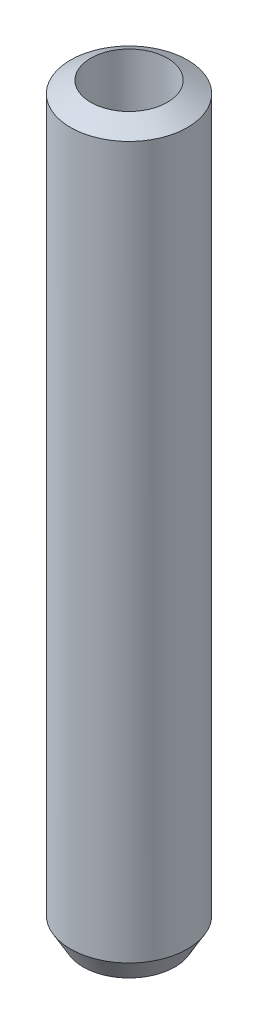
ISO-10303-21;
HEADER;
FILE_DESCRIPTION(('STEP AP214'),'2;1');
FILE_NAME('part.step','',(''),(''),'','','');
FILE_SCHEMA(('AUTOMOTIVE_DESIGN { 1 0 10303 214 1 1 1 1 }'));
ENDSEC;
DATA;
#1=APPLICATION_CONTEXT('core data for automotive mechanical design processes');
#2=APPLICATION_PROTOCOL_DEFINITION('international standard','automotive_design',2000,#1);
#3=PRODUCT_CONTEXT('',#1,'mechanical');
#4=PRODUCT('Part','Part','',(#3));
#5=PRODUCT_RELATED_PRODUCT_CATEGORY('part','',(#4));
#6=PRODUCT_DEFINITION_FORMATION('','',#4);
#7=PRODUCT_DEFINITION_CONTEXT('part definition',#1,'design');
#8=PRODUCT_DEFINITION('design','',#6,#7);
#9=PRODUCT_DEFINITION_SHAPE('','',#8);
#10=(LENGTH_UNIT() NAMED_UNIT(*) SI_UNIT(.MILLI.,.METRE.));
#11=(NAMED_UNIT(*) PLANE_ANGLE_UNIT() SI_UNIT($,.RADIAN.));
#12=(NAMED_UNIT(*) SI_UNIT($,.STERADIAN.) SOLID_ANGLE_UNIT());
#13=UNCERTAINTY_MEASURE_WITH_UNIT(LENGTH_MEASURE(1.E-05),#10,'distance_accuracy_value','');
#14=(GEOMETRIC_REPRESENTATION_CONTEXT(3) GLOBAL_UNCERTAINTY_ASSIGNED_CONTEXT((#13)) GLOBAL_UNIT_ASSIGNED_CONTEXT((#10,
#11,#12)) REPRESENTATION_CONTEXT('',''));
#15=CARTESIAN_POINT('',(0.,0.,0.));
#16=DIRECTION('',(0.,0.,1.));
#17=DIRECTION('',(1.,0.,0.));
#18=AXIS2_PLACEMENT_3D('',#15,#16,#17);
#19=CARTESIAN_POINT('',(0.,223.172952411425,0.));
#20=DIRECTION('',(0.,-1.,0.));
#21=DIRECTION('',(0.,0.,-1.));
#22=AXIS2_PLACEMENT_3D('',#19,#20,#21);
#23=CYLINDRICAL_SURFACE('',#22,17.5);
#24=CARTESIAN_POINT('',(0.,219.380455718945,0.));
#25=DIRECTION('',(0.,1.,0.));
#26=DIRECTION('',(0.,0.,1.));
#27=AXIS2_PLACEMENT_3D('',#24,#25,#26);
#28=CIRCLE('',#27,17.5);
#29=CARTESIAN_POINT('',(0.,219.380455718945,-17.5));
#30=VERTEX_POINT('',#29);
#31=EDGE_CURVE('E50',#30,#30,#28,.F.);
#32=ORIENTED_EDGE('',*,*,#31,.T.);
#33=EDGE_LOOP('',(#32));
#34=FACE_BOUND('',#33,.T.);
#35=CARTESIAN_POINT('',(0.,6.56879695891199,0.));
#36=DIRECTION('',(0.,1.,0.));
#37=DIRECTION('',(0.,0.,1.));
#38=AXIS2_PLACEMENT_3D('',#35,#36,#37);
#39=CIRCLE('',#38,17.5);
#40=CARTESIAN_POINT('',(0.,6.56879695891199,17.5));
#41=VERTEX_POINT('',#40);
#42=EDGE_CURVE('E51',#41,#41,#39,.T.);
#43=ORIENTED_EDGE('',*,*,#42,.T.);
#44=EDGE_LOOP('',(#43));
#45=FACE_BOUND('',#44,.T.);
#46=ADVANCED_FACE('F39',(#34,#45),#23,.T.);
#47=CARTESIAN_POINT('',(0.,0.,0.));
#48=DIRECTION('',(0.,1.,0.));
#49=DIRECTION('',(0.,0.,1.));
#50=AXIS2_PLACEMENT_3D('',#47,#48,#49);
#51=PLANE('',#50);
#52=CARTESIAN_POINT('',(0.,0.,0.));
#53=DIRECTION('',(0.,1.,0.));
#54=DIRECTION('',(0.,0.,1.));
#55=AXIS2_PLACEMENT_3D('',#52,#53,#54);
#56=CIRCLE('',#55,13.7075033075201);
#57=CARTESIAN_POINT('',(0.,0.,13.7075033075201));
#58=VERTEX_POINT('',#57);
#59=EDGE_CURVE('E10',#58,#58,#56,.F.);
#60=ORIENTED_EDGE('',*,*,#59,.T.);
#61=EDGE_LOOP('',(#60));
#62=FACE_BOUND('',#61,.T.);
#63=CARTESIAN_POINT('',(0.,0.,0.));
#64=DIRECTION('',(0.,1.,0.));
#65=DIRECTION('',(0.,0.,1.));
#66=AXIS2_PLACEMENT_3D('',#63,#64,#65);
#67=CIRCLE('',#66,11.4574612930232);
#68=CARTESIAN_POINT('',(0.,0.,11.4574612930232));
#69=VERTEX_POINT('',#68);
#70=EDGE_CURVE('E58',#69,#69,#67,.T.);
#71=ORIENTED_EDGE('',*,*,#70,.T.);
#72=EDGE_LOOP('',(#71));
#73=FACE_BOUND('',#72,.T.);
#74=ADVANCED_FACE('F62',(#62,#73),#51,.F.);
#75=CARTESIAN_POINT('',(0.,223.172952411425,0.));
#76=DIRECTION('',(0.,-1.,0.));
#77=DIRECTION('',(0.,0.,-1.));
#78=AXIS2_PLACEMENT_3D('',#75,#76,#77);
#79=CYLINDRICAL_SURFACE('',#78,11.4574612930232);
#80=CARTESIAN_POINT('',(0.,222.869117068007,0.));
#81=DIRECTION('',(0.,-1.,0.));
#82=DIRECTION('',(0.,0.,-1.));
#83=AXIS2_PLACEMENT_3D('',#80,#81,#82);
#84=CIRCLE('',#83,11.4574612930232);
#85=CARTESIAN_POINT('',(0.,222.869117068007,-11.4574612930232));
#86=VERTEX_POINT('',#85);
#87=EDGE_CURVE('E54',#86,#86,#84,.F.);
#88=ORIENTED_EDGE('',*,*,#87,.T.);
#89=EDGE_LOOP('',(#88));
#90=FACE_BOUND('',#89,.T.);
#91=ORIENTED_EDGE('',*,*,#70,.F.);
#92=EDGE_LOOP('',(#91));
#93=FACE_BOUND('',#92,.T.);
#94=ADVANCED_FACE('F68',(#90,#93),#79,.F.);
#95=CARTESIAN_POINT('',(0.,223.172952411425,0.));
#96=DIRECTION('',(0.,-1.,0.));
#97=DIRECTION('',(0.,0.,-1.));
#98=AXIS2_PLACEMENT_3D('',#95,#96,#97);
#99=CONICAL_SURFACE('',#98,10.9312030410878,1.0471975511966);
#100=CARTESIAN_POINT('',(0.,219.380455718945,-17.5));
#101=CARTESIAN_POINT('',(0.,219.416795941331,-17.437056888469));
#102=CARTESIAN_POINT('',(0.,219.453136163717,-17.374113776938));
#103=CARTESIAN_POINT('',(0.,219.525816608489,-17.248227553876));
#104=CARTESIAN_POINT('',(0.,219.562156830875,-17.185284442345));
#105=CARTESIAN_POINT('',(0.,219.634837275647,-17.059398219283));
#106=CARTESIAN_POINT('',(0.,219.671177498033,-16.996455107752));
#107=CARTESIAN_POINT('',(0.,219.743857942805,-16.8705688846899));
#108=CARTESIAN_POINT('',(0.,219.780198165192,-16.8076257731589));
#109=CARTESIAN_POINT('',(0.,219.852878609964,-16.6817395500969));
#110=CARTESIAN_POINT('',(0.,219.88921883235,-16.6187964385659));
#111=CARTESIAN_POINT('',(0.,219.961899277122,-16.4929102155039));
#112=CARTESIAN_POINT('',(0.,219.998239499508,-16.4299671039729));
#113=CARTESIAN_POINT('',(0.,220.07091994428,-16.3040808809109));
#114=CARTESIAN_POINT('',(0.,220.107260166666,-16.2411377693799));
#115=CARTESIAN_POINT('',(0.,220.179940611438,-16.1152515463178));
#116=CARTESIAN_POINT('',(0.,220.216280833824,-16.0523084347868));
#117=CARTESIAN_POINT('',(0.,220.288961278596,-15.9264222117248));
#118=CARTESIAN_POINT('',(0.,220.325301500982,-15.8634791001938));
#119=CARTESIAN_POINT('',(0.,220.397981945755,-15.7375928771318));
#120=CARTESIAN_POINT('',(0.,220.434322168141,-15.6746497656008));
#121=CARTESIAN_POINT('',(0.,220.507002612913,-15.5487635425388));
#122=CARTESIAN_POINT('',(0.,220.543342835299,-15.4858204310078));
#123=CARTESIAN_POINT('',(0.,220.616023280071,-15.3599342079457));
#124=CARTESIAN_POINT('',(0.,220.652363502457,-15.2969910964147));
#125=CARTESIAN_POINT('',(0.,220.725043947229,-15.1711048733527));
#126=CARTESIAN_POINT('',(0.,220.761384169615,-15.1081617618217));
#127=CARTESIAN_POINT('',(0.,220.834064614387,-14.9822755387597));
#128=CARTESIAN_POINT('',(0.,220.870404836773,-14.9193324272287));
#129=CARTESIAN_POINT('',(0.,220.943085281545,-14.7934462041667));
#130=CARTESIAN_POINT('',(0.,220.979425503931,-14.7305030926357));
#131=CARTESIAN_POINT('',(0.,221.052105948704,-14.6046168695736));
#132=CARTESIAN_POINT('',(0.,221.08844617109,-14.5416737580426));
#133=CARTESIAN_POINT('',(0.,221.161126615862,-14.4157875349806));
#134=CARTESIAN_POINT('',(0.,221.197466838248,-14.3528444234496));
#135=CARTESIAN_POINT('',(0.,221.27014728302,-14.2269582003876));
#136=CARTESIAN_POINT('',(0.,221.306487505406,-14.1640150888566));
#137=CARTESIAN_POINT('',(0.,221.379167950178,-14.0381288657946));
#138=CARTESIAN_POINT('',(0.,221.415508172564,-13.9751857542636));
#139=CARTESIAN_POINT('',(0.,221.488188617336,-13.8492995312015));
#140=CARTESIAN_POINT('',(0.,221.524528839722,-13.7863564196705));
#141=CARTESIAN_POINT('',(0.,221.597209284495,-13.6604701966085));
#142=CARTESIAN_POINT('',(0.,221.633549506881,-13.5975270850775));
#143=CARTESIAN_POINT('',(0.,221.706229951653,-13.4716408620155));
#144=CARTESIAN_POINT('',(0.,221.742570174039,-13.4086977504845));
#145=CARTESIAN_POINT('',(0.,221.815250618811,-13.2828115274225));
#146=CARTESIAN_POINT('',(0.,221.851590841197,-13.2198684158915));
#147=CARTESIAN_POINT('',(0.,221.924271285969,-13.0939821928294));
#148=CARTESIAN_POINT('',(0.,221.960611508355,-13.0310390812984));
#149=CARTESIAN_POINT('',(0.,222.033291953127,-12.9051528582364));
#150=CARTESIAN_POINT('',(0.,222.069632175513,-12.8422097467054));
#151=CARTESIAN_POINT('',(0.,222.142312620285,-12.7163235236434));
#152=CARTESIAN_POINT('',(0.,222.178652842671,-12.6533804121124));
#153=CARTESIAN_POINT('',(0.,222.251333287444,-12.5274941890504));
#154=CARTESIAN_POINT('',(0.,222.28767350983,-12.4645510775194));
#155=CARTESIAN_POINT('',(0.,222.360353954602,-12.3386648544573));
#156=CARTESIAN_POINT('',(0.,222.396694176988,-12.2757217429263));
#157=CARTESIAN_POINT('',(0.,222.46937462176,-12.1498355198643));
#158=CARTESIAN_POINT('',(0.,222.505714844146,-12.0868924083333));
#159=CARTESIAN_POINT('',(0.,222.578395288918,-11.9610061852713));
#160=CARTESIAN_POINT('',(0.,222.614735511304,-11.8980630737403));
#161=CARTESIAN_POINT('',(0.,222.687415956076,-11.7721768506783));
#162=CARTESIAN_POINT('',(0.,222.723756178462,-11.7092337391473));
#163=CARTESIAN_POINT('',(0.,222.796436623234,-11.5833475160852));
#164=CARTESIAN_POINT('',(0.,222.832776845621,-11.5204044045542));
#165=CARTESIAN_POINT('',(0.,222.869117068007,-11.4574612930232));
#166=B_SPLINE_CURVE_WITH_KNOTS('',3,(#100,#101,#102,#103,#104,#105,#106,#107,#108,#109,#110,
#111,#112,#113,#114,#115,#116,#117,#118,#119,#120,#121,#122,#123,#124,#125,#126,#127,#128,#129,
#130,#131,#132,#133,#134,#135,#136,#137,#138,#139,#140,#141,#142,#143,#144,#145,#146,#147,#148,
#149,#150,#151,#152,#153,#154,#155,#156,#157,#158,#159,#160,#161,#162,#163,#164,#165),
.UNSPECIFIED.,.F.,.F.,(4,2,2,2,2,2,2,2,2,2,2,2,2,2,2,2,2,2,2,2,2,2,2,2,2,2,2,2,2,2,2,2,4),(0.,
0.21804133431636,0.43608266863272,0.654124002949083,0.87216533726544,1.0902066715818,
1.30824800589816,1.52628934021452,1.7443306745309,1.96237200884726,2.18041334316362,
2.39845467747998,2.61649601179634,2.8345373461127,3.05257868042906,3.27062001474542,
3.48866134906179,3.70670268337815,3.92474401769451,4.14278535201087,4.36082668632723,
4.57886802064359,4.79690935495995,5.01495068927631,5.23299202359269,5.45103335790905,
5.66907469222541,5.88711602654177,6.10515736085813,6.32319869517449,6.54124002949085,
6.75928136380721,6.97732269812358),.UNSPECIFIED.);
#167=EDGE_CURVE('BSEAM66',#30,#86,#166,.T.);
#168=ORIENTED_EDGE('',*,*,#31,.F.);
#169=ORIENTED_EDGE('',*,*,#87,.F.);
#170=ORIENTED_EDGE('',*,*,#167,.T.);
#171=ORIENTED_EDGE('',*,*,#167,.F.);
#172=EDGE_LOOP('',(#168,#170,#169,#171));
#173=FACE_BOUND('',#172,.T.);
#174=ADVANCED_FACE('F66',(#173),#99,.T.);
#175=CARTESIAN_POINT('',(0.,6.56879695891199,0.));
#176=DIRECTION('',(0.,1.,0.));
#177=DIRECTION('',(0.,0.,1.));
#178=AXIS2_PLACEMENT_3D('',#175,#176,#177);
#179=CONICAL_SURFACE('',#178,17.5,0.523598775598302);
#180=ORIENTED_EDGE('',*,*,#59,.F.);
#181=EDGE_LOOP('',(#180));
#182=FACE_BOUND('',#181,.T.);
#183=ORIENTED_EDGE('',*,*,#42,.F.);
#184=EDGE_LOOP('',(#183));
#185=FACE_BOUND('',#184,.T.);
#186=ADVANCED_FACE('F45',(#182,#185),#179,.T.);
#187=CLOSED_SHELL('',(#46,#74,#94,#174,#186));
#188=MANIFOLD_SOLID_BREP('B2',#187);
#189=ADVANCED_BREP_SHAPE_REPRESENTATION('',(#18,#188),#14);
#190=SHAPE_DEFINITION_REPRESENTATION(#9,#189);
ENDSEC;
END-ISO-10303-21;
